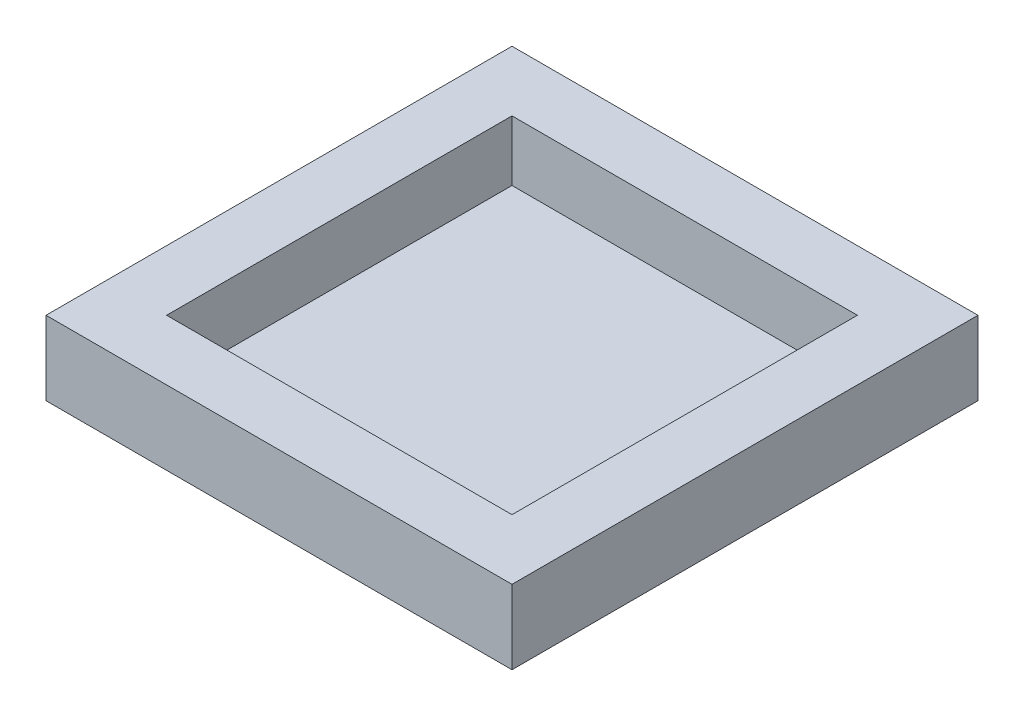
ISO-10303-21;
HEADER;
FILE_DESCRIPTION(('STEP AP214'),'2;1');
FILE_NAME('part.step','',(''),(''),'','','');
FILE_SCHEMA(('AUTOMOTIVE_DESIGN { 1 0 10303 214 1 1 1 1 }'));
ENDSEC;
DATA;
#1=APPLICATION_CONTEXT('core data for automotive mechanical design processes');
#2=APPLICATION_PROTOCOL_DEFINITION('international standard','automotive_design',2000,#1);
#3=PRODUCT_CONTEXT('',#1,'mechanical');
#4=PRODUCT('Part','Part','',(#3));
#5=PRODUCT_RELATED_PRODUCT_CATEGORY('part','',(#4));
#6=PRODUCT_DEFINITION_FORMATION('','',#4);
#7=PRODUCT_DEFINITION_CONTEXT('part definition',#1,'design');
#8=PRODUCT_DEFINITION('design','',#6,#7);
#9=PRODUCT_DEFINITION_SHAPE('','',#8);
#10=(LENGTH_UNIT() NAMED_UNIT(*) SI_UNIT(.MILLI.,.METRE.));
#11=(NAMED_UNIT(*) PLANE_ANGLE_UNIT() SI_UNIT($,.RADIAN.));
#12=(NAMED_UNIT(*) SI_UNIT($,.STERADIAN.) SOLID_ANGLE_UNIT());
#13=UNCERTAINTY_MEASURE_WITH_UNIT(LENGTH_MEASURE(1.E-05),#10,'distance_accuracy_value','');
#14=(GEOMETRIC_REPRESENTATION_CONTEXT(3) GLOBAL_UNCERTAINTY_ASSIGNED_CONTEXT((#13)) GLOBAL_UNIT_ASSIGNED_CONTEXT((#10,
#11,#12)) REPRESENTATION_CONTEXT('',''));
#15=CARTESIAN_POINT('',(0.,0.,0.));
#16=DIRECTION('',(0.,0.,1.));
#17=DIRECTION('',(1.,0.,0.));
#18=AXIS2_PLACEMENT_3D('',#15,#16,#17);
#19=CARTESIAN_POINT('',(0.,5.,0.));
#20=DIRECTION('',(1.,0.,0.));
#21=DIRECTION('',(0.,0.,-1.));
#22=AXIS2_PLACEMENT_3D('',#19,#20,#21);
#23=PLANE('',#22);
#24=DIRECTION('',(0.,0.,1.));
#25=VECTOR('',#24,1.);
#26=CARTESIAN_POINT('',(0.,0.,0.));
#27=LINE('',#26,#25);
#28=CARTESIAN_POINT('',(0.,0.,-170.));
#29=VERTEX_POINT('',#28);
#30=CARTESIAN_POINT('',(0.,0.,0.));
#31=VERTEX_POINT('',#30);
#32=EDGE_CURVE('E147',#29,#31,#27,.T.);
#33=ORIENTED_EDGE('',*,*,#32,.T.);
#34=DIRECTION('',(0.,-1.,0.));
#35=VECTOR('',#34,1.);
#36=CARTESIAN_POINT('',(0.,5.,0.));
#37=LINE('',#36,#35);
#38=CARTESIAN_POINT('',(0.,27.,0.));
#39=VERTEX_POINT('',#38);
#40=EDGE_CURVE('E11',#39,#31,#37,.T.);
#41=ORIENTED_EDGE('',*,*,#40,.F.);
#42=DIRECTION('',(0.,0.,1.));
#43=VECTOR('',#42,1.);
#44=CARTESIAN_POINT('',(0.,27.,-170.));
#45=LINE('',#44,#43);
#46=CARTESIAN_POINT('',(0.,27.,-170.));
#47=VERTEX_POINT('',#46);
#48=EDGE_CURVE('E112',#47,#39,#45,.T.);
#49=ORIENTED_EDGE('',*,*,#48,.F.);
#50=DIRECTION('',(0.,-1.,0.));
#51=VECTOR('',#50,1.);
#52=CARTESIAN_POINT('',(0.,5.,-170.));
#53=LINE('',#52,#51);
#54=EDGE_CURVE('E155',#47,#29,#53,.T.);
#55=ORIENTED_EDGE('',*,*,#54,.T.);
#56=EDGE_LOOP('',(#33,#41,#49,#55));
#57=FACE_BOUND('',#56,.T.);
#58=ADVANCED_FACE('F30',(#57),#23,.F.);
#59=CARTESIAN_POINT('',(0.,5.,0.));
#60=DIRECTION('',(0.,0.,-1.));
#61=DIRECTION('',(-1.,0.,0.));
#62=AXIS2_PLACEMENT_3D('',#59,#60,#61);
#63=PLANE('',#62);
#64=DIRECTION('',(1.,0.,0.));
#65=VECTOR('',#64,1.);
#66=CARTESIAN_POINT('',(0.,0.,0.));
#67=LINE('',#66,#65);
#68=CARTESIAN_POINT('',(170.,0.,0.));
#69=VERTEX_POINT('',#68);
#70=EDGE_CURVE('E150',#31,#69,#67,.T.);
#71=ORIENTED_EDGE('',*,*,#70,.T.);
#72=DIRECTION('',(0.,-1.,0.));
#73=VECTOR('',#72,1.);
#74=CARTESIAN_POINT('',(170.,5.,0.));
#75=LINE('',#74,#73);
#76=CARTESIAN_POINT('',(170.,27.,0.));
#77=VERTEX_POINT('',#76);
#78=EDGE_CURVE('E37',#77,#69,#75,.T.);
#79=ORIENTED_EDGE('',*,*,#78,.F.);
#80=DIRECTION('',(1.,0.,0.));
#81=VECTOR('',#80,1.);
#82=CARTESIAN_POINT('',(0.,27.,0.));
#83=LINE('',#82,#81);
#84=EDGE_CURVE('E138',#39,#77,#83,.T.);
#85=ORIENTED_EDGE('',*,*,#84,.F.);
#86=ORIENTED_EDGE('',*,*,#40,.T.);
#87=EDGE_LOOP('',(#71,#79,#85,#86));
#88=FACE_BOUND('',#87,.T.);
#89=ADVANCED_FACE('F173',(#88),#63,.F.);
#90=CARTESIAN_POINT('',(170.,5.,0.));
#91=DIRECTION('',(-1.,0.,0.));
#92=DIRECTION('',(0.,0.,1.));
#93=AXIS2_PLACEMENT_3D('',#90,#91,#92);
#94=PLANE('',#93);
#95=DIRECTION('',(0.,0.,-1.));
#96=VECTOR('',#95,1.);
#97=CARTESIAN_POINT('',(170.,0.,0.));
#98=LINE('',#97,#96);
#99=CARTESIAN_POINT('',(170.,0.,-170.));
#100=VERTEX_POINT('',#99);
#101=EDGE_CURVE('E152',#69,#100,#98,.T.);
#102=ORIENTED_EDGE('',*,*,#101,.T.);
#103=DIRECTION('',(0.,-1.,0.));
#104=VECTOR('',#103,1.);
#105=CARTESIAN_POINT('',(170.,5.,-170.));
#106=LINE('',#105,#104);
#107=CARTESIAN_POINT('',(170.,27.,-170.));
#108=VERTEX_POINT('',#107);
#109=EDGE_CURVE('E157',#108,#100,#106,.T.);
#110=ORIENTED_EDGE('',*,*,#109,.F.);
#111=DIRECTION('',(0.,0.,-1.));
#112=VECTOR('',#111,1.);
#113=CARTESIAN_POINT('',(170.,27.,-170.));
#114=LINE('',#113,#112);
#115=EDGE_CURVE('E141',#77,#108,#114,.T.);
#116=ORIENTED_EDGE('',*,*,#115,.F.);
#117=ORIENTED_EDGE('',*,*,#78,.T.);
#118=EDGE_LOOP('',(#102,#110,#116,#117));
#119=FACE_BOUND('',#118,.T.);
#120=ADVANCED_FACE('F162',(#119),#94,.F.);
#121=CARTESIAN_POINT('',(0.,5.,-170.));
#122=DIRECTION('',(0.,0.,1.));
#123=DIRECTION('',(1.,0.,0.));
#124=AXIS2_PLACEMENT_3D('',#121,#122,#123);
#125=PLANE('',#124);
#126=DIRECTION('',(-1.,0.,0.));
#127=VECTOR('',#126,1.);
#128=CARTESIAN_POINT('',(0.,0.,-170.));
#129=LINE('',#128,#127);
#130=EDGE_CURVE('E52',#100,#29,#129,.T.);
#131=ORIENTED_EDGE('',*,*,#130,.T.);
#132=ORIENTED_EDGE('',*,*,#54,.F.);
#133=DIRECTION('',(-1.,0.,0.));
#134=VECTOR('',#133,1.);
#135=CARTESIAN_POINT('',(0.,27.,-170.));
#136=LINE('',#135,#134);
#137=EDGE_CURVE('E144',#108,#47,#136,.T.);
#138=ORIENTED_EDGE('',*,*,#137,.F.);
#139=ORIENTED_EDGE('',*,*,#109,.T.);
#140=EDGE_LOOP('',(#131,#132,#138,#139));
#141=FACE_BOUND('',#140,.T.);
#142=ADVANCED_FACE('F171',(#141),#125,.F.);
#143=CARTESIAN_POINT('',(0.,0.,-170.));
#144=DIRECTION('',(0.,-1.,0.));
#145=DIRECTION('',(0.,0.,-1.));
#146=AXIS2_PLACEMENT_3D('',#143,#144,#145);
#147=PLANE('',#146);
#148=ORIENTED_EDGE('',*,*,#32,.F.);
#149=ORIENTED_EDGE('',*,*,#130,.F.);
#150=ORIENTED_EDGE('',*,*,#101,.F.);
#151=ORIENTED_EDGE('',*,*,#70,.F.);
#152=EDGE_LOOP('',(#148,#149,#150,#151));
#153=FACE_BOUND('',#152,.T.);
#154=ADVANCED_FACE('F167',(#153),#147,.T.);
#155=CARTESIAN_POINT('',(0.,27.,0.));
#156=DIRECTION('',(0.,1.,0.));
#157=DIRECTION('',(0.,0.,1.));
#158=AXIS2_PLACEMENT_3D('',#155,#156,#157);
#159=PLANE('',#158);
#160=ORIENTED_EDGE('',*,*,#48,.T.);
#161=ORIENTED_EDGE('',*,*,#84,.T.);
#162=ORIENTED_EDGE('',*,*,#115,.T.);
#163=ORIENTED_EDGE('',*,*,#137,.T.);
#164=EDGE_LOOP('',(#160,#161,#162,#163));
#165=FACE_BOUND('',#164,.T.);
#166=DIRECTION('',(1.,0.,0.));
#167=VECTOR('',#166,1.);
#168=CARTESIAN_POINT('',(22.,27.,-22.));
#169=LINE('',#168,#167);
#170=CARTESIAN_POINT('',(22.,27.,-22.));
#171=VERTEX_POINT('',#170);
#172=CARTESIAN_POINT('',(148.,27.,-22.));
#173=VERTEX_POINT('',#172);
#174=EDGE_CURVE('E104',#171,#173,#169,.T.);
#175=ORIENTED_EDGE('',*,*,#174,.F.);
#176=DIRECTION('',(0.,0.,1.));
#177=VECTOR('',#176,1.);
#178=CARTESIAN_POINT('',(22.,27.,-148.));
#179=LINE('',#178,#177);
#180=CARTESIAN_POINT('',(22.,27.,-148.));
#181=VERTEX_POINT('',#180);
#182=EDGE_CURVE('E96',#181,#171,#179,.T.);
#183=ORIENTED_EDGE('',*,*,#182,.F.);
#184=DIRECTION('',(-1.,0.,0.));
#185=VECTOR('',#184,1.);
#186=CARTESIAN_POINT('',(22.,27.,-148.));
#187=LINE('',#186,#185);
#188=CARTESIAN_POINT('',(148.,27.,-148.));
#189=VERTEX_POINT('',#188);
#190=EDGE_CURVE('E120',#189,#181,#187,.T.);
#191=ORIENTED_EDGE('',*,*,#190,.F.);
#192=DIRECTION('',(0.,0.,-1.));
#193=VECTOR('',#192,1.);
#194=CARTESIAN_POINT('',(148.,27.,-148.));
#195=LINE('',#194,#193);
#196=EDGE_CURVE('E118',#173,#189,#195,.T.);
#197=ORIENTED_EDGE('',*,*,#196,.F.);
#198=EDGE_LOOP('',(#175,#183,#191,#197));
#199=FACE_BOUND('',#198,.T.);
#200=ADVANCED_FACE('F116',(#165,#199),#159,.T.);
#201=CARTESIAN_POINT('',(22.,27.,-148.));
#202=DIRECTION('',(1.,0.,0.));
#203=DIRECTION('',(0.,0.,-1.));
#204=AXIS2_PLACEMENT_3D('',#201,#202,#203);
#205=PLANE('',#204);
#206=DIRECTION('',(0.,0.,1.));
#207=VECTOR('',#206,1.);
#208=CARTESIAN_POINT('',(22.,5.,-148.));
#209=LINE('',#208,#207);
#210=CARTESIAN_POINT('',(22.,5.,-148.));
#211=VERTEX_POINT('',#210);
#212=CARTESIAN_POINT('',(22.,5.,-22.));
#213=VERTEX_POINT('',#212);
#214=EDGE_CURVE('E124',#211,#213,#209,.T.);
#215=ORIENTED_EDGE('',*,*,#214,.F.);
#216=DIRECTION('',(0.,-1.,0.));
#217=VECTOR('',#216,1.);
#218=CARTESIAN_POINT('',(22.,27.,-148.));
#219=LINE('',#218,#217);
#220=EDGE_CURVE('E44',#181,#211,#219,.T.);
#221=ORIENTED_EDGE('',*,*,#220,.F.);
#222=ORIENTED_EDGE('',*,*,#182,.T.);
#223=DIRECTION('',(0.,-1.,0.));
#224=VECTOR('',#223,1.);
#225=CARTESIAN_POINT('',(22.,27.,-22.));
#226=LINE('',#225,#224);
#227=EDGE_CURVE('E99',#171,#213,#226,.T.);
#228=ORIENTED_EDGE('',*,*,#227,.T.);
#229=EDGE_LOOP('',(#215,#221,#222,#228));
#230=FACE_BOUND('',#229,.T.);
#231=ADVANCED_FACE('F98',(#230),#205,.T.);
#232=CARTESIAN_POINT('',(22.,27.,-22.));
#233=DIRECTION('',(0.,0.,-1.));
#234=DIRECTION('',(-1.,0.,0.));
#235=AXIS2_PLACEMENT_3D('',#232,#233,#234);
#236=PLANE('',#235);
#237=DIRECTION('',(1.,0.,0.));
#238=VECTOR('',#237,1.);
#239=CARTESIAN_POINT('',(22.,5.,-22.));
#240=LINE('',#239,#238);
#241=CARTESIAN_POINT('',(148.,5.,-22.));
#242=VERTEX_POINT('',#241);
#243=EDGE_CURVE('E111',#213,#242,#240,.T.);
#244=ORIENTED_EDGE('',*,*,#243,.F.);
#245=ORIENTED_EDGE('',*,*,#227,.F.);
#246=ORIENTED_EDGE('',*,*,#174,.T.);
#247=DIRECTION('',(0.,-1.,0.));
#248=VECTOR('',#247,1.);
#249=CARTESIAN_POINT('',(148.,27.,-22.));
#250=LINE('',#249,#248);
#251=EDGE_CURVE('E113',#173,#242,#250,.T.);
#252=ORIENTED_EDGE('',*,*,#251,.T.);
#253=EDGE_LOOP('',(#244,#245,#246,#252));
#254=FACE_BOUND('',#253,.T.);
#255=ADVANCED_FACE('F108',(#254),#236,.T.);
#256=CARTESIAN_POINT('',(148.,27.,-148.));
#257=DIRECTION('',(-1.,0.,0.));
#258=DIRECTION('',(0.,0.,1.));
#259=AXIS2_PLACEMENT_3D('',#256,#257,#258);
#260=PLANE('',#259);
#261=DIRECTION('',(0.,0.,-1.));
#262=VECTOR('',#261,1.);
#263=CARTESIAN_POINT('',(148.,5.,-148.));
#264=LINE('',#263,#262);
#265=CARTESIAN_POINT('',(148.,5.,-148.));
#266=VERTEX_POINT('',#265);
#267=EDGE_CURVE('E127',#242,#266,#264,.T.);
#268=ORIENTED_EDGE('',*,*,#267,.F.);
#269=ORIENTED_EDGE('',*,*,#251,.F.);
#270=ORIENTED_EDGE('',*,*,#196,.T.);
#271=DIRECTION('',(0.,-1.,0.));
#272=VECTOR('',#271,1.);
#273=CARTESIAN_POINT('',(148.,27.,-148.));
#274=LINE('',#273,#272);
#275=EDGE_CURVE('E133',#189,#266,#274,.T.);
#276=ORIENTED_EDGE('',*,*,#275,.T.);
#277=EDGE_LOOP('',(#268,#269,#270,#276));
#278=FACE_BOUND('',#277,.T.);
#279=ADVANCED_FACE('F196',(#278),#260,.T.);
#280=CARTESIAN_POINT('',(22.,27.,-148.));
#281=DIRECTION('',(0.,0.,1.));
#282=DIRECTION('',(1.,0.,0.));
#283=AXIS2_PLACEMENT_3D('',#280,#281,#282);
#284=PLANE('',#283);
#285=DIRECTION('',(-1.,0.,0.));
#286=VECTOR('',#285,1.);
#287=CARTESIAN_POINT('',(22.,5.,-148.));
#288=LINE('',#287,#286);
#289=EDGE_CURVE('E105',#266,#211,#288,.T.);
#290=ORIENTED_EDGE('',*,*,#289,.F.);
#291=ORIENTED_EDGE('',*,*,#275,.F.);
#292=ORIENTED_EDGE('',*,*,#190,.T.);
#293=ORIENTED_EDGE('',*,*,#220,.T.);
#294=EDGE_LOOP('',(#290,#291,#292,#293));
#295=FACE_BOUND('',#294,.T.);
#296=ADVANCED_FACE('F188',(#295),#284,.T.);
#297=CARTESIAN_POINT('',(0.,5.,-170.));
#298=DIRECTION('',(0.,-1.,0.));
#299=DIRECTION('',(0.,0.,-1.));
#300=AXIS2_PLACEMENT_3D('',#297,#298,#299);
#301=PLANE('',#300);
#302=ORIENTED_EDGE('',*,*,#289,.T.);
#303=ORIENTED_EDGE('',*,*,#214,.T.);
#304=ORIENTED_EDGE('',*,*,#243,.T.);
#305=ORIENTED_EDGE('',*,*,#267,.T.);
#306=EDGE_LOOP('',(#302,#303,#304,#305));
#307=FACE_BOUND('',#306,.T.);
#308=ADVANCED_FACE('F185',(#307),#301,.F.);
#309=CLOSED_SHELL('',(#58,#89,#120,#142,#154,#200,#231,#255,#279,#296,#308));
#310=MANIFOLD_SOLID_BREP('B2',#309);
#311=ADVANCED_BREP_SHAPE_REPRESENTATION('',(#18,#310),#14);
#312=SHAPE_DEFINITION_REPRESENTATION(#9,#311);
ENDSEC;
END-ISO-10303-21;
